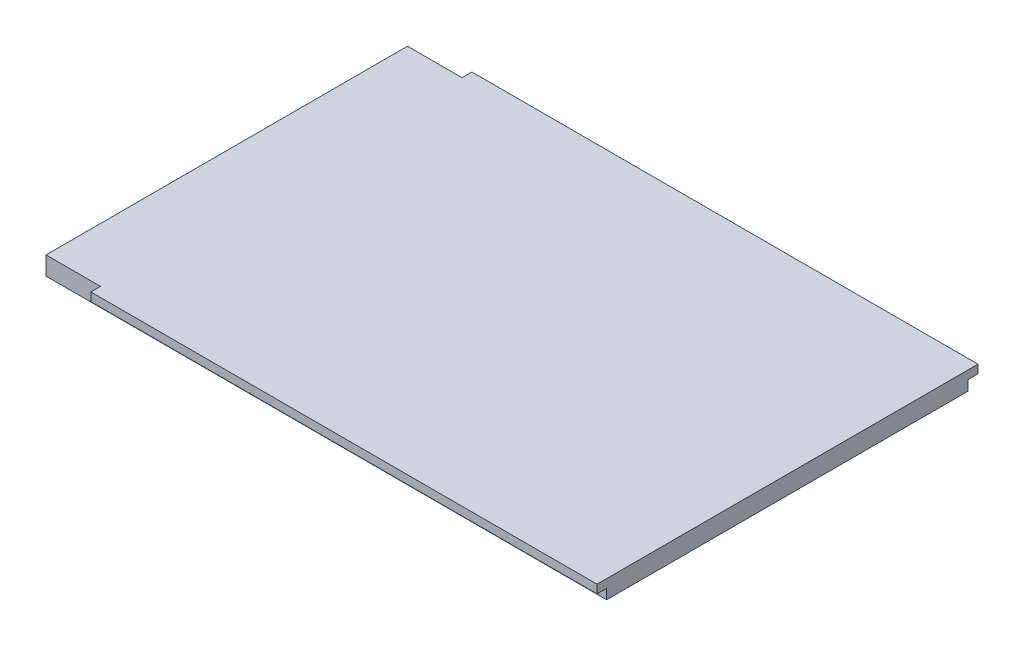
ISO-10303-21;
HEADER;
FILE_DESCRIPTION(('STEP AP214'),'2;1');
FILE_NAME('part.step','',(''),(''),'','','');
FILE_SCHEMA(('AUTOMOTIVE_DESIGN { 1 0 10303 214 1 1 1 1 }'));
ENDSEC;
DATA;
#1=APPLICATION_CONTEXT('core data for automotive mechanical design processes');
#2=APPLICATION_PROTOCOL_DEFINITION('international standard','automotive_design',2000,#1);
#3=PRODUCT_CONTEXT('',#1,'mechanical');
#4=PRODUCT('Part','Part','',(#3));
#5=PRODUCT_RELATED_PRODUCT_CATEGORY('part','',(#4));
#6=PRODUCT_DEFINITION_FORMATION('','',#4);
#7=PRODUCT_DEFINITION_CONTEXT('part definition',#1,'design');
#8=PRODUCT_DEFINITION('design','',#6,#7);
#9=PRODUCT_DEFINITION_SHAPE('','',#8);
#10=(LENGTH_UNIT() NAMED_UNIT(*) SI_UNIT(.MILLI.,.METRE.));
#11=(NAMED_UNIT(*) PLANE_ANGLE_UNIT() SI_UNIT($,.RADIAN.));
#12=(NAMED_UNIT(*) SI_UNIT($,.STERADIAN.) SOLID_ANGLE_UNIT());
#13=UNCERTAINTY_MEASURE_WITH_UNIT(LENGTH_MEASURE(1.E-05),#10,'distance_accuracy_value','');
#14=(GEOMETRIC_REPRESENTATION_CONTEXT(3) GLOBAL_UNCERTAINTY_ASSIGNED_CONTEXT((#13)) GLOBAL_UNIT_ASSIGNED_CONTEXT((#10,
#11,#12)) REPRESENTATION_CONTEXT('',''));
#15=CARTESIAN_POINT('',(0.,0.,0.));
#16=DIRECTION('',(0.,0.,1.));
#17=DIRECTION('',(1.,0.,0.));
#18=AXIS2_PLACEMENT_3D('',#15,#16,#17);
#19=CARTESIAN_POINT('',(0.,-20.1861353711791,765.499865735748));
#20=DIRECTION('',(1.,0.,0.));
#21=DIRECTION('',(0.,0.,-1.));
#22=AXIS2_PLACEMENT_3D('',#19,#20,#21);
#23=PLANE('',#22);
#24=DIRECTION('',(0.,-1.,0.));
#25=VECTOR('',#24,1.);
#26=CARTESIAN_POINT('',(0.,-20.1861353711791,300.));
#27=LINE('',#26,#25);
#28=CARTESIAN_POINT('',(0.,-4.93613537117908,300.));
#29=VERTEX_POINT('',#28);
#30=CARTESIAN_POINT('',(0.,-20.186135371179,300.));
#31=VERTEX_POINT('',#30);
#32=EDGE_CURVE('E176',#29,#31,#27,.T.);
#33=ORIENTED_EDGE('',*,*,#32,.F.);
#34=DIRECTION('',(0.,0.,-1.));
#35=VECTOR('',#34,1.);
#36=CARTESIAN_POINT('',(0.,-4.93613537117908,765.499865735748));
#37=LINE('',#36,#35);
#38=CARTESIAN_POINT('',(0.,-4.93613537117908,0.));
#39=VERTEX_POINT('',#38);
#40=EDGE_CURVE('E165',#29,#39,#37,.T.);
#41=ORIENTED_EDGE('',*,*,#40,.T.);
#42=DIRECTION('',(0.,-1.,0.));
#43=VECTOR('',#42,1.);
#44=CARTESIAN_POINT('',(0.,-20.1861353711791,0.));
#45=LINE('',#44,#43);
#46=CARTESIAN_POINT('',(0.,-20.1861353711791,0.));
#47=VERTEX_POINT('',#46);
#48=EDGE_CURVE('E154',#39,#47,#45,.T.);
#49=ORIENTED_EDGE('',*,*,#48,.T.);
#50=DIRECTION('',(0.,0.,-1.));
#51=VECTOR('',#50,1.);
#52=CARTESIAN_POINT('',(0.,-20.1861353711791,765.499865735748));
#53=LINE('',#52,#51);
#54=EDGE_CURVE('E172',#31,#47,#53,.T.);
#55=ORIENTED_EDGE('',*,*,#54,.F.);
#56=EDGE_LOOP('',(#33,#41,#49,#55));
#57=FACE_BOUND('',#56,.T.);
#58=ADVANCED_FACE('F32',(#57),#23,.F.);
#59=CARTESIAN_POINT('',(0.,-20.1861353711791,765.499865735748));
#60=DIRECTION('',(0.,1.,0.));
#61=DIRECTION('',(0.,0.,1.));
#62=AXIS2_PLACEMENT_3D('',#59,#60,#61);
#63=PLANE('',#62);
#64=DIRECTION('',(1.,0.,0.));
#65=VECTOR('',#64,1.);
#66=CARTESIAN_POINT('',(0.,-20.1861353711791,300.));
#67=LINE('',#66,#65);
#68=CARTESIAN_POINT('',(465.25,-20.186135371179,300.));
#69=VERTEX_POINT('',#68);
#70=EDGE_CURVE('E178',#31,#69,#67,.T.);
#71=ORIENTED_EDGE('',*,*,#70,.F.);
#72=ORIENTED_EDGE('',*,*,#54,.T.);
#73=DIRECTION('',(1.,0.,0.));
#74=VECTOR('',#73,1.);
#75=CARTESIAN_POINT('',(0.,-20.1861353711791,0.));
#76=LINE('',#75,#74);
#77=CARTESIAN_POINT('',(465.25,-20.1861353711791,0.));
#78=VERTEX_POINT('',#77);
#79=EDGE_CURVE('E157',#47,#78,#76,.T.);
#80=ORIENTED_EDGE('',*,*,#79,.T.);
#81=DIRECTION('',(0.,0.,-1.));
#82=VECTOR('',#81,1.);
#83=CARTESIAN_POINT('',(465.25,-20.1861353711791,765.499865735748));
#84=LINE('',#83,#82);
#85=EDGE_CURVE('E170',#69,#78,#84,.T.);
#86=ORIENTED_EDGE('',*,*,#85,.F.);
#87=EDGE_LOOP('',(#71,#72,#80,#86));
#88=FACE_BOUND('',#87,.T.);
#89=ADVANCED_FACE('F198',(#88),#63,.F.);
#90=CARTESIAN_POINT('',(465.25,-20.1861353711791,765.499865735748));
#91=DIRECTION('',(-1.,0.,0.));
#92=DIRECTION('',(0.,0.,1.));
#93=AXIS2_PLACEMENT_3D('',#90,#91,#92);
#94=PLANE('',#93);
#95=DIRECTION('',(0.,1.,0.));
#96=VECTOR('',#95,1.);
#97=CARTESIAN_POINT('',(465.25,-20.1861353711791,0.));
#98=LINE('',#97,#96);
#99=CARTESIAN_POINT('',(465.25,-11.9361353711791,0.));
#100=VERTEX_POINT('',#99);
#101=EDGE_CURVE('E160',#78,#100,#98,.T.);
#102=ORIENTED_EDGE('',*,*,#101,.T.);
#103=DIRECTION('',(0.,0.,-1.));
#104=VECTOR('',#103,1.);
#105=CARTESIAN_POINT('',(465.25,-11.9361353711791,308.));
#106=LINE('',#105,#104);
#107=CARTESIAN_POINT('',(465.25,-11.9361353711791,-8.17735241966489));
#108=VERTEX_POINT('',#107);
#109=EDGE_CURVE('E141',#100,#108,#106,.T.);
#110=ORIENTED_EDGE('',*,*,#109,.T.);
#111=DIRECTION('',(0.,1.,0.));
#112=VECTOR('',#111,1.);
#113=CARTESIAN_POINT('',(465.25,-4.93613537117908,-8.17735241966489));
#114=LINE('',#113,#112);
#115=CARTESIAN_POINT('',(465.25,-4.93613537117908,-8.17735241966489));
#116=VERTEX_POINT('',#115);
#117=EDGE_CURVE('E129',#108,#116,#114,.T.);
#118=ORIENTED_EDGE('',*,*,#117,.T.);
#119=DIRECTION('',(0.,0.,-1.));
#120=VECTOR('',#119,1.);
#121=CARTESIAN_POINT('',(465.25,-4.93613537117908,765.499865735748));
#122=LINE('',#121,#120);
#123=CARTESIAN_POINT('',(465.25,-4.93613537117908,308.));
#124=VERTEX_POINT('',#123);
#125=EDGE_CURVE('E168',#124,#116,#122,.T.);
#126=ORIENTED_EDGE('',*,*,#125,.F.);
#127=DIRECTION('',(0.,-1.,0.));
#128=VECTOR('',#127,1.);
#129=CARTESIAN_POINT('',(465.25,-4.93613537117908,308.));
#130=LINE('',#129,#128);
#131=CARTESIAN_POINT('',(465.25,-11.9361353711791,308.));
#132=VERTEX_POINT('',#131);
#133=EDGE_CURVE('E139',#124,#132,#130,.T.);
#134=ORIENTED_EDGE('',*,*,#133,.T.);
#135=CARTESIAN_POINT('',(465.25,-11.9361353711791,300.));
#136=VERTEX_POINT('',#135);
#137=EDGE_CURVE('E109',#132,#136,#106,.T.);
#138=ORIENTED_EDGE('',*,*,#137,.T.);
#139=DIRECTION('',(0.,1.,0.));
#140=VECTOR('',#139,1.);
#141=CARTESIAN_POINT('',(465.25,-20.1861353711791,300.));
#142=LINE('',#141,#140);
#143=EDGE_CURVE('E49',#69,#136,#142,.T.);
#144=ORIENTED_EDGE('',*,*,#143,.F.);
#145=ORIENTED_EDGE('',*,*,#85,.T.);
#146=EDGE_LOOP('',(#102,#110,#118,#126,#134,#138,#144,#145));
#147=FACE_BOUND('',#146,.T.);
#148=ADVANCED_FACE('F200',(#147),#94,.F.);
#149=CARTESIAN_POINT('',(0.,-4.93613537117908,765.499865735748));
#150=DIRECTION('',(0.,-1.,0.));
#151=DIRECTION('',(0.,0.,-1.));
#152=AXIS2_PLACEMENT_3D('',#149,#150,#151);
#153=PLANE('',#152);
#154=ORIENTED_EDGE('',*,*,#125,.T.);
#155=DIRECTION('',(1.,0.,0.));
#156=VECTOR('',#155,1.);
#157=CARTESIAN_POINT('',(45.25,-4.93613537117908,-8.17735241966489));
#158=LINE('',#157,#156);
#159=CARTESIAN_POINT('',(45.25,-4.93613537117908,-8.17735241966489));
#160=VERTEX_POINT('',#159);
#161=EDGE_CURVE('E145',#160,#116,#158,.T.);
#162=ORIENTED_EDGE('',*,*,#161,.F.);
#163=DIRECTION('',(0.,0.,1.));
#164=VECTOR('',#163,1.);
#165=CARTESIAN_POINT('',(45.25,-4.93613537117908,308.));
#166=LINE('',#165,#164);
#167=CARTESIAN_POINT('',(45.25,-4.93613537117908,0.));
#168=VERTEX_POINT('',#167);
#169=EDGE_CURVE('E115',#160,#168,#166,.T.);
#170=ORIENTED_EDGE('',*,*,#169,.T.);
#171=DIRECTION('',(-1.,0.,0.));
#172=VECTOR('',#171,1.);
#173=CARTESIAN_POINT('',(0.,-4.93613537117908,0.));
#174=LINE('',#173,#172);
#175=EDGE_CURVE('E163',#168,#39,#174,.T.);
#176=ORIENTED_EDGE('',*,*,#175,.T.);
#177=ORIENTED_EDGE('',*,*,#40,.F.);
#178=DIRECTION('',(-1.,0.,0.));
#179=VECTOR('',#178,1.);
#180=CARTESIAN_POINT('',(0.,-4.93613537117908,300.));
#181=LINE('',#180,#179);
#182=CARTESIAN_POINT('',(45.25,-4.93613537117908,300.));
#183=VERTEX_POINT('',#182);
#184=EDGE_CURVE('E174',#183,#29,#181,.T.);
#185=ORIENTED_EDGE('',*,*,#184,.F.);
#186=CARTESIAN_POINT('',(45.25,-4.93613537117908,308.));
#187=VERTEX_POINT('',#186);
#188=EDGE_CURVE('E136',#183,#187,#166,.T.);
#189=ORIENTED_EDGE('',*,*,#188,.T.);
#190=DIRECTION('',(1.,0.,0.));
#191=VECTOR('',#190,1.);
#192=CARTESIAN_POINT('',(45.25,-4.93613537117908,308.));
#193=LINE('',#192,#191);
#194=EDGE_CURVE('E128',#187,#124,#193,.T.);
#195=ORIENTED_EDGE('',*,*,#194,.T.);
#196=EDGE_LOOP('',(#154,#162,#170,#176,#177,#185,#189,#195));
#197=FACE_BOUND('',#196,.T.);
#198=ADVANCED_FACE('F185',(#197),#153,.F.);
#199=CARTESIAN_POINT('',(0.,0.,0.));
#200=DIRECTION('',(0.,0.,-1.));
#201=DIRECTION('',(-1.,0.,0.));
#202=AXIS2_PLACEMENT_3D('',#199,#200,#201);
#203=PLANE('',#202);
#204=DIRECTION('',(-1.,0.,0.));
#205=VECTOR('',#204,1.);
#206=CARTESIAN_POINT('',(0.,-11.9361353711791,0.));
#207=LINE('',#206,#205);
#208=CARTESIAN_POINT('',(45.25,-11.9361353711791,0.));
#209=VERTEX_POINT('',#208);
#210=EDGE_CURVE('E152',#100,#209,#207,.T.);
#211=ORIENTED_EDGE('',*,*,#210,.F.);
#212=ORIENTED_EDGE('',*,*,#101,.F.);
#213=ORIENTED_EDGE('',*,*,#79,.F.);
#214=ORIENTED_EDGE('',*,*,#48,.F.);
#215=ORIENTED_EDGE('',*,*,#175,.F.);
#216=DIRECTION('',(0.,-1.,0.));
#217=VECTOR('',#216,1.);
#218=CARTESIAN_POINT('',(45.25,0.,0.));
#219=LINE('',#218,#217);
#220=EDGE_CURVE('E144',#168,#209,#219,.T.);
#221=ORIENTED_EDGE('',*,*,#220,.T.);
#222=EDGE_LOOP('',(#211,#212,#213,#214,#215,#221));
#223=FACE_BOUND('',#222,.T.);
#224=ADVANCED_FACE('F193',(#223),#203,.T.);
#225=CARTESIAN_POINT('',(465.25,-20.186135371179,300.));
#226=DIRECTION('',(0.,0.,1.));
#227=DIRECTION('',(1.,0.,0.));
#228=AXIS2_PLACEMENT_3D('',#225,#226,#227);
#229=PLANE('',#228);
#230=DIRECTION('',(1.,0.,0.));
#231=VECTOR('',#230,1.);
#232=CARTESIAN_POINT('',(465.25,-11.9361353711791,300.));
#233=LINE('',#232,#231);
#234=CARTESIAN_POINT('',(45.25,-11.9361353711791,300.));
#235=VERTEX_POINT('',#234);
#236=EDGE_CURVE('E11',#235,#136,#233,.T.);
#237=ORIENTED_EDGE('',*,*,#236,.F.);
#238=DIRECTION('',(0.,1.,0.));
#239=VECTOR('',#238,1.);
#240=CARTESIAN_POINT('',(45.25,-20.186135371179,300.));
#241=LINE('',#240,#239);
#242=EDGE_CURVE('E39',#235,#183,#241,.T.);
#243=ORIENTED_EDGE('',*,*,#242,.T.);
#244=ORIENTED_EDGE('',*,*,#184,.T.);
#245=ORIENTED_EDGE('',*,*,#32,.T.);
#246=ORIENTED_EDGE('',*,*,#70,.T.);
#247=ORIENTED_EDGE('',*,*,#143,.T.);
#248=EDGE_LOOP('',(#237,#243,#244,#245,#246,#247));
#249=FACE_BOUND('',#248,.T.);
#250=ADVANCED_FACE('F181',(#249),#229,.T.);
#251=CARTESIAN_POINT('',(45.25,-4.93613537117908,308.));
#252=DIRECTION('',(0.,0.,1.));
#253=DIRECTION('',(1.,0.,0.));
#254=AXIS2_PLACEMENT_3D('',#251,#252,#253);
#255=PLANE('',#254);
#256=ORIENTED_EDGE('',*,*,#133,.F.);
#257=ORIENTED_EDGE('',*,*,#194,.F.);
#258=DIRECTION('',(0.,-1.,0.));
#259=VECTOR('',#258,1.);
#260=CARTESIAN_POINT('',(45.25,-4.93613537117908,308.));
#261=LINE('',#260,#259);
#262=CARTESIAN_POINT('',(45.25,-11.9361353711791,308.));
#263=VERTEX_POINT('',#262);
#264=EDGE_CURVE('E121',#187,#263,#261,.T.);
#265=ORIENTED_EDGE('',*,*,#264,.T.);
#266=DIRECTION('',(1.,0.,0.));
#267=VECTOR('',#266,1.);
#268=CARTESIAN_POINT('',(45.25,-11.9361353711791,308.));
#269=LINE('',#268,#267);
#270=EDGE_CURVE('E104',#263,#132,#269,.T.);
#271=ORIENTED_EDGE('',*,*,#270,.T.);
#272=EDGE_LOOP('',(#256,#257,#265,#271));
#273=FACE_BOUND('',#272,.T.);
#274=ADVANCED_FACE('F126',(#273),#255,.T.);
#275=CARTESIAN_POINT('',(45.25,0.,0.));
#276=DIRECTION('',(1.,0.,0.));
#277=DIRECTION('',(0.,0.,-1.));
#278=AXIS2_PLACEMENT_3D('',#275,#276,#277);
#279=PLANE('',#278);
#280=ORIENTED_EDGE('',*,*,#242,.F.);
#281=DIRECTION('',(0.,0.,-1.));
#282=VECTOR('',#281,1.);
#283=CARTESIAN_POINT('',(45.25,-11.9361353711791,308.));
#284=LINE('',#283,#282);
#285=EDGE_CURVE('E107',#263,#235,#284,.T.);
#286=ORIENTED_EDGE('',*,*,#285,.F.);
#287=ORIENTED_EDGE('',*,*,#264,.F.);
#288=ORIENTED_EDGE('',*,*,#188,.F.);
#289=EDGE_LOOP('',(#280,#286,#287,#288));
#290=FACE_BOUND('',#289,.T.);
#291=ADVANCED_FACE('F119',(#290),#279,.F.);
#292=CARTESIAN_POINT('',(45.25,-11.9361353711791,308.));
#293=DIRECTION('',(0.,-1.,0.));
#294=DIRECTION('',(0.,0.,-1.));
#295=AXIS2_PLACEMENT_3D('',#292,#293,#294);
#296=PLANE('',#295);
#297=ORIENTED_EDGE('',*,*,#285,.T.);
#298=ORIENTED_EDGE('',*,*,#236,.T.);
#299=ORIENTED_EDGE('',*,*,#137,.F.);
#300=ORIENTED_EDGE('',*,*,#270,.F.);
#301=EDGE_LOOP('',(#297,#298,#299,#300));
#302=FACE_BOUND('',#301,.T.);
#303=ADVANCED_FACE('F106',(#302),#296,.T.);
#304=ORIENTED_EDGE('',*,*,#109,.F.);
#305=ORIENTED_EDGE('',*,*,#210,.T.);
#306=CARTESIAN_POINT('',(45.25,-11.9361353711791,-8.17735241966489));
#307=VERTEX_POINT('',#306);
#308=EDGE_CURVE('E123',#209,#307,#284,.T.);
#309=ORIENTED_EDGE('',*,*,#308,.T.);
#310=DIRECTION('',(1.,0.,0.));
#311=VECTOR('',#310,1.);
#312=CARTESIAN_POINT('',(45.25,-11.9361353711791,-8.17735241966489));
#313=LINE('',#312,#311);
#314=EDGE_CURVE('E114',#307,#108,#313,.T.);
#315=ORIENTED_EDGE('',*,*,#314,.T.);
#316=EDGE_LOOP('',(#304,#305,#309,#315));
#317=FACE_BOUND('',#316,.T.);
#318=ADVANCED_FACE('F211',(#317),#296,.T.);
#319=ORIENTED_EDGE('',*,*,#220,.F.);
#320=ORIENTED_EDGE('',*,*,#169,.F.);
#321=DIRECTION('',(0.,1.,0.));
#322=VECTOR('',#321,1.);
#323=CARTESIAN_POINT('',(45.25,-4.93613537117908,-8.17735241966489));
#324=LINE('',#323,#322);
#325=EDGE_CURVE('E122',#307,#160,#324,.T.);
#326=ORIENTED_EDGE('',*,*,#325,.F.);
#327=ORIENTED_EDGE('',*,*,#308,.F.);
#328=EDGE_LOOP('',(#319,#320,#326,#327));
#329=FACE_BOUND('',#328,.T.);
#330=ADVANCED_FACE('F209',(#329),#279,.F.);
#331=CARTESIAN_POINT('',(45.25,-4.93613537117908,-8.17735241966489));
#332=DIRECTION('',(0.,0.,-1.));
#333=DIRECTION('',(0.,1.,0.));
#334=AXIS2_PLACEMENT_3D('',#331,#332,#333);
#335=PLANE('',#334);
#336=ORIENTED_EDGE('',*,*,#117,.F.);
#337=ORIENTED_EDGE('',*,*,#314,.F.);
#338=ORIENTED_EDGE('',*,*,#325,.T.);
#339=ORIENTED_EDGE('',*,*,#161,.T.);
#340=EDGE_LOOP('',(#336,#337,#338,#339));
#341=FACE_BOUND('',#340,.T.);
#342=ADVANCED_FACE('F203',(#341),#335,.T.);
#343=CLOSED_SHELL('',(#58,#89,#148,#198,#224,#250,#274,#291,#303,#318,#330,#342));
#344=MANIFOLD_SOLID_BREP('B2',#343);
#345=ADVANCED_BREP_SHAPE_REPRESENTATION('',(#18,#344),#14);
#346=SHAPE_DEFINITION_REPRESENTATION(#9,#345);
ENDSEC;
END-ISO-10303-21;
